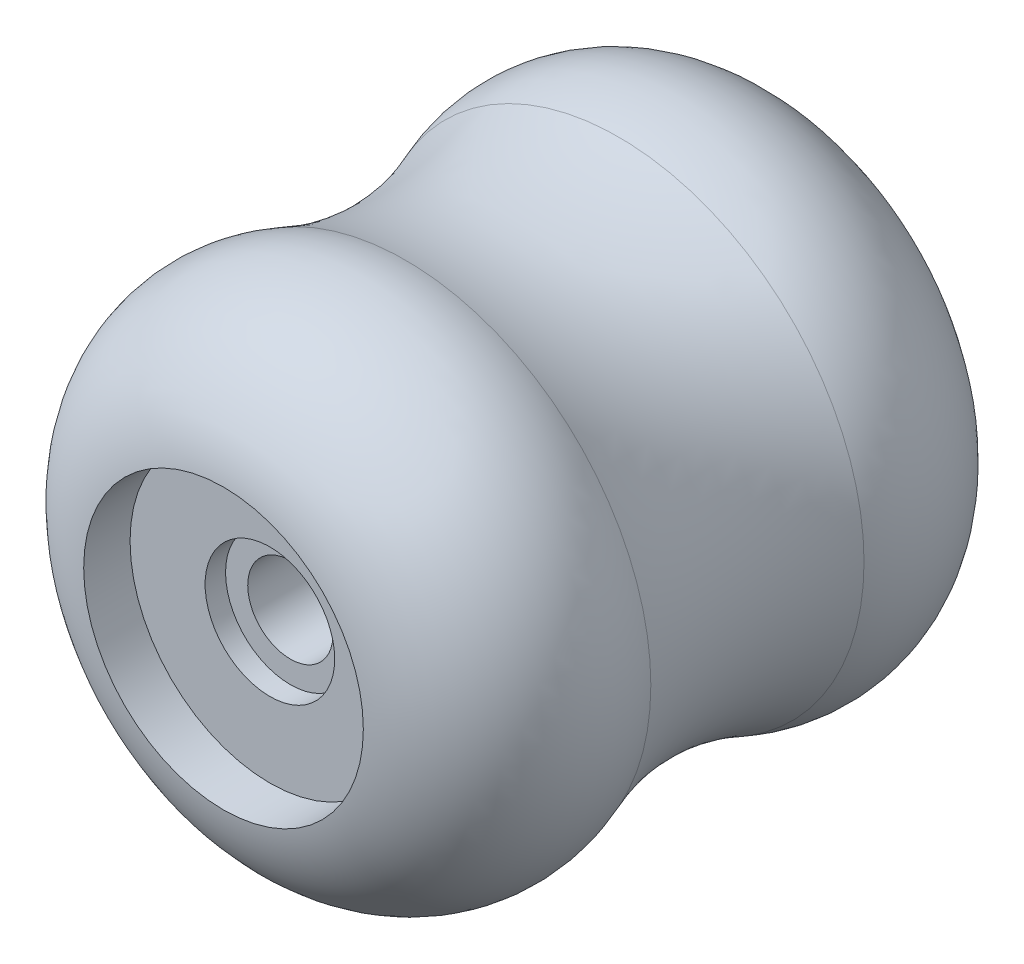
ISO-10303-21;
HEADER;
FILE_DESCRIPTION(('STEP AP214'),'2;1');
FILE_NAME('part.step','',(''),(''),'','','');
FILE_SCHEMA(('AUTOMOTIVE_DESIGN { 1 0 10303 214 1 1 1 1 }'));
ENDSEC;
DATA;
#1=APPLICATION_CONTEXT('core data for automotive mechanical design processes');
#2=APPLICATION_PROTOCOL_DEFINITION('international standard','automotive_design',2000,#1);
#3=PRODUCT_CONTEXT('',#1,'mechanical');
#4=PRODUCT('Part','Part','',(#3));
#5=PRODUCT_RELATED_PRODUCT_CATEGORY('part','',(#4));
#6=PRODUCT_DEFINITION_FORMATION('','',#4);
#7=PRODUCT_DEFINITION_CONTEXT('part definition',#1,'design');
#8=PRODUCT_DEFINITION('design','',#6,#7);
#9=PRODUCT_DEFINITION_SHAPE('','',#8);
#10=(LENGTH_UNIT() NAMED_UNIT(*) SI_UNIT(.MILLI.,.METRE.));
#11=(NAMED_UNIT(*) PLANE_ANGLE_UNIT() SI_UNIT($,.RADIAN.));
#12=(NAMED_UNIT(*) SI_UNIT($,.STERADIAN.) SOLID_ANGLE_UNIT());
#13=UNCERTAINTY_MEASURE_WITH_UNIT(LENGTH_MEASURE(1.E-05),#10,'distance_accuracy_value','');
#14=(GEOMETRIC_REPRESENTATION_CONTEXT(3) GLOBAL_UNCERTAINTY_ASSIGNED_CONTEXT((#13)) GLOBAL_UNIT_ASSIGNED_CONTEXT((#10,
#11,#12)) REPRESENTATION_CONTEXT('',''));
#15=CARTESIAN_POINT('',(0.,0.,0.));
#16=DIRECTION('',(0.,0.,1.));
#17=DIRECTION('',(1.,0.,0.));
#18=AXIS2_PLACEMENT_3D('',#15,#16,#17);
#19=CARTESIAN_POINT('',(0.,0.,21.59));
#20=DIRECTION('',(0.,0.,-1.));
#21=DIRECTION('',(-1.,0.,0.));
#22=AXIS2_PLACEMENT_3D('',#19,#20,#21);
#23=CYLINDRICAL_SURFACE('',#22,3.175);
#24=CARTESIAN_POINT('',(0.,0.,-16.51));
#25=DIRECTION('',(0.,0.,-1.));
#26=DIRECTION('',(-1.,0.,0.));
#27=AXIS2_PLACEMENT_3D('',#24,#25,#26);
#28=CIRCLE('',#27,3.175);
#29=CARTESIAN_POINT('',(-3.17500000000001,0.,-16.51));
#30=VERTEX_POINT('',#29);
#31=EDGE_CURVE('E73',#30,#30,#28,.T.);
#32=ORIENTED_EDGE('',*,*,#31,.T.);
#33=EDGE_LOOP('',(#32));
#34=FACE_BOUND('',#33,.T.);
#35=CARTESIAN_POINT('',(0.,0.,16.51));
#36=DIRECTION('',(0.,0.,-1.));
#37=DIRECTION('',(-1.,0.,0.));
#38=AXIS2_PLACEMENT_3D('',#35,#36,#37);
#39=CIRCLE('',#38,3.175);
#40=CARTESIAN_POINT('',(-3.17500000000001,0.,16.51));
#41=VERTEX_POINT('',#40);
#42=EDGE_CURVE('E89',#41,#41,#39,.T.);
#43=ORIENTED_EDGE('',*,*,#42,.F.);
#44=EDGE_LOOP('',(#43));
#45=FACE_BOUND('',#44,.T.);
#46=ADVANCED_FACE('F37',(#34,#45),#23,.F.);
#47=CARTESIAN_POINT('',(0.,0.,11.6091603767689));
#48=DIRECTION('',(0.,0.,1.));
#49=DIRECTION('',(1.,0.,0.));
#50=AXIS2_PLACEMENT_3D('',#47,#48,#49);
#51=DEGENERATE_TOROIDAL_SURFACE('',#50,8.99509487970923,9.98083962323108,.T.);
#52=CARTESIAN_POINT('',(0.,0.,7.93902777137447));
#53=DIRECTION('',(0.,0.,1.));
#54=DIRECTION('',(1.,0.,0.));
#55=AXIS2_PLACEMENT_3D('',#52,#53,#54);
#56=CIRCLE('',#55,18.2766511200969);
#57=CARTESIAN_POINT('',(18.2766511200969,0.,7.93902777137446));
#58=VERTEX_POINT('',#57);
#59=EDGE_CURVE('E46',#58,#58,#56,.T.);
#60=ORIENTED_EDGE('',*,*,#59,.T.);
#61=EDGE_LOOP('',(#60));
#62=FACE_BOUND('',#61,.T.);
#63=CARTESIAN_POINT('',(0.,0.,21.4886273585586));
#64=DIRECTION('',(0.,0.,-1.));
#65=DIRECTION('',(-1.,0.,0.));
#66=AXIS2_PLACEMENT_3D('',#63,#64,#65);
#67=CIRCLE('',#66,10.414);
#68=CARTESIAN_POINT('',(-10.414,0.,21.4886273585586));
#69=VERTEX_POINT('',#68);
#70=EDGE_CURVE('E41',#69,#69,#67,.F.);
#71=ORIENTED_EDGE('',*,*,#70,.F.);
#72=EDGE_LOOP('',(#71));
#73=FACE_BOUND('',#72,.T.);
#74=ADVANCED_FACE('F98',(#62,#73),#51,.T.);
#75=CARTESIAN_POINT('',(0.,0.,-11.6091603767689));
#76=DIRECTION('',(0.,0.,1.));
#77=DIRECTION('',(1.,0.,0.));
#78=AXIS2_PLACEMENT_3D('',#75,#76,#77);
#79=DEGENERATE_TOROIDAL_SURFACE('',#78,8.99509487970922,9.98083962323107,.T.);
#80=CARTESIAN_POINT('',(0.,0.,-21.4886273585586));
#81=DIRECTION('',(0.,0.,1.));
#82=DIRECTION('',(1.,0.,0.));
#83=AXIS2_PLACEMENT_3D('',#80,#81,#82);
#84=CIRCLE('',#83,10.414);
#85=CARTESIAN_POINT('',(10.414,0.,-21.4886273585586));
#86=VERTEX_POINT('',#85);
#87=EDGE_CURVE('E52',#86,#86,#84,.T.);
#88=ORIENTED_EDGE('',*,*,#87,.T.);
#89=EDGE_LOOP('',(#88));
#90=FACE_BOUND('',#89,.T.);
#91=CARTESIAN_POINT('',(0.,0.,-7.93902777137448));
#92=DIRECTION('',(0.,0.,1.));
#93=DIRECTION('',(1.,0.,0.));
#94=AXIS2_PLACEMENT_3D('',#91,#92,#93);
#95=CIRCLE('',#94,18.2766511200969);
#96=CARTESIAN_POINT('',(18.2766511200969,0.,-7.93902777137448));
#97=VERTEX_POINT('',#96);
#98=EDGE_CURVE('E10',#97,#97,#95,.T.);
#99=ORIENTED_EDGE('',*,*,#98,.F.);
#100=EDGE_LOOP('',(#99));
#101=FACE_BOUND('',#100,.T.);
#102=ADVANCED_FACE('F39',(#90,#101),#79,.T.);
#103=CARTESIAN_POINT('',(0.,0.,0.));
#104=DIRECTION('',(0.,0.,1.));
#105=DIRECTION('',(1.,0.,0.));
#106=AXIS2_PLACEMENT_3D('',#103,#104,#105);
#107=TOROIDAL_SURFACE('',#106,38.354,21.59);
#108=ORIENTED_EDGE('',*,*,#59,.F.);
#109=EDGE_LOOP('',(#108));
#110=FACE_BOUND('',#109,.T.);
#111=ORIENTED_EDGE('',*,*,#98,.T.);
#112=EDGE_LOOP('',(#111));
#113=FACE_BOUND('',#112,.T.);
#114=ADVANCED_FACE('F123',(#110,#113),#107,.F.);
#115=CARTESIAN_POINT('',(0.,0.,-18.034));
#116=DIRECTION('',(0.,0.,-1.));
#117=DIRECTION('',(-1.,0.,0.));
#118=AXIS2_PLACEMENT_3D('',#115,#116,#117);
#119=CYLINDRICAL_SURFACE('',#118,10.414);
#120=CARTESIAN_POINT('',(0.,0.,-18.034));
#121=DIRECTION('',(0.,0.,-1.));
#122=DIRECTION('',(-1.,0.,0.));
#123=AXIS2_PLACEMENT_3D('',#120,#121,#122);
#124=CIRCLE('',#123,10.414);
#125=CARTESIAN_POINT('',(-10.414,0.,-18.034));
#126=VERTEX_POINT('',#125);
#127=EDGE_CURVE('E57',#126,#126,#124,.T.);
#128=ORIENTED_EDGE('',*,*,#127,.F.);
#129=EDGE_LOOP('',(#128));
#130=FACE_BOUND('',#129,.T.);
#131=ORIENTED_EDGE('',*,*,#87,.F.);
#132=EDGE_LOOP('',(#131));
#133=FACE_BOUND('',#132,.T.);
#134=ADVANCED_FACE('F121',(#130,#133),#119,.F.);
#135=CARTESIAN_POINT('',(0.,0.,-18.034));
#136=DIRECTION('',(0.,0.,-1.));
#137=DIRECTION('',(-1.,0.,0.));
#138=AXIS2_PLACEMENT_3D('',#135,#136,#137);
#139=PLANE('',#138);
#140=ORIENTED_EDGE('',*,*,#127,.T.);
#141=EDGE_LOOP('',(#140));
#142=FACE_BOUND('',#141,.T.);
#143=CARTESIAN_POINT('',(0.,0.,-18.034));
#144=DIRECTION('',(0.,0.,-1.));
#145=DIRECTION('',(-1.,0.,0.));
#146=AXIS2_PLACEMENT_3D('',#143,#144,#145);
#147=CIRCLE('',#146,4.826);
#148=CARTESIAN_POINT('',(-4.82600000000001,0.,-18.034));
#149=VERTEX_POINT('',#148);
#150=EDGE_CURVE('E62',#149,#149,#147,.T.);
#151=ORIENTED_EDGE('',*,*,#150,.F.);
#152=EDGE_LOOP('',(#151));
#153=FACE_BOUND('',#152,.T.);
#154=ADVANCED_FACE('F117',(#142,#153),#139,.T.);
#155=CARTESIAN_POINT('',(0.,0.,-16.51));
#156=DIRECTION('',(0.,0.,-1.));
#157=DIRECTION('',(-1.,0.,0.));
#158=AXIS2_PLACEMENT_3D('',#155,#156,#157);
#159=CYLINDRICAL_SURFACE('',#158,4.826);
#160=ORIENTED_EDGE('',*,*,#150,.T.);
#161=EDGE_LOOP('',(#160));
#162=FACE_BOUND('',#161,.T.);
#163=CARTESIAN_POINT('',(0.,0.,-16.51));
#164=DIRECTION('',(0.,0.,-1.));
#165=DIRECTION('',(-1.,0.,0.));
#166=AXIS2_PLACEMENT_3D('',#163,#164,#165);
#167=CIRCLE('',#166,4.826);
#168=CARTESIAN_POINT('',(-4.82600000000001,0.,-16.51));
#169=VERTEX_POINT('',#168);
#170=EDGE_CURVE('E67',#169,#169,#167,.T.);
#171=ORIENTED_EDGE('',*,*,#170,.F.);
#172=EDGE_LOOP('',(#171));
#173=FACE_BOUND('',#172,.T.);
#174=ADVANCED_FACE('F113',(#162,#173),#159,.F.);
#175=CARTESIAN_POINT('',(0.,0.,-16.51));
#176=DIRECTION('',(0.,0.,-1.));
#177=DIRECTION('',(-1.,0.,0.));
#178=AXIS2_PLACEMENT_3D('',#175,#176,#177);
#179=PLANE('',#178);
#180=ORIENTED_EDGE('',*,*,#31,.F.);
#181=EDGE_LOOP('',(#180));
#182=FACE_BOUND('',#181,.T.);
#183=ORIENTED_EDGE('',*,*,#170,.T.);
#184=EDGE_LOOP('',(#183));
#185=FACE_BOUND('',#184,.T.);
#186=ADVANCED_FACE('F110',(#182,#185),#179,.T.);
#187=CARTESIAN_POINT('',(0.,0.,18.034));
#188=DIRECTION('',(0.,0.,1.));
#189=DIRECTION('',(1.,0.,0.));
#190=AXIS2_PLACEMENT_3D('',#187,#188,#189);
#191=CYLINDRICAL_SURFACE('',#190,10.414);
#192=CARTESIAN_POINT('',(0.,0.,18.034));
#193=DIRECTION('',(0.,0.,-1.));
#194=DIRECTION('',(-1.,0.,0.));
#195=AXIS2_PLACEMENT_3D('',#192,#193,#194);
#196=CIRCLE('',#195,10.414);
#197=CARTESIAN_POINT('',(-10.414,0.,18.034));
#198=VERTEX_POINT('',#197);
#199=EDGE_CURVE('E77',#198,#198,#196,.T.);
#200=ORIENTED_EDGE('',*,*,#199,.T.);
#201=EDGE_LOOP('',(#200));
#202=FACE_BOUND('',#201,.T.);
#203=ORIENTED_EDGE('',*,*,#70,.T.);
#204=EDGE_LOOP('',(#203));
#205=FACE_BOUND('',#204,.T.);
#206=ADVANCED_FACE('F108',(#202,#205),#191,.F.);
#207=CARTESIAN_POINT('',(0.,0.,18.034));
#208=DIRECTION('',(0.,0.,1.));
#209=DIRECTION('',(-1.,0.,0.));
#210=AXIS2_PLACEMENT_3D('',#207,#208,#209);
#211=PLANE('',#210);
#212=ORIENTED_EDGE('',*,*,#199,.F.);
#213=EDGE_LOOP('',(#212));
#214=FACE_BOUND('',#213,.T.);
#215=CARTESIAN_POINT('',(0.,0.,18.034));
#216=DIRECTION('',(0.,0.,1.));
#217=DIRECTION('',(1.,0.,0.));
#218=AXIS2_PLACEMENT_3D('',#215,#216,#217);
#219=CIRCLE('',#218,4.826);
#220=CARTESIAN_POINT('',(4.82599999999999,0.,18.034));
#221=VERTEX_POINT('',#220);
#222=EDGE_CURVE('E81',#221,#221,#219,.F.);
#223=ORIENTED_EDGE('',*,*,#222,.T.);
#224=EDGE_LOOP('',(#223));
#225=FACE_BOUND('',#224,.T.);
#226=ADVANCED_FACE('F137',(#214,#225),#211,.T.);
#227=CARTESIAN_POINT('',(0.,0.,16.51));
#228=DIRECTION('',(0.,0.,1.));
#229=DIRECTION('',(1.,0.,0.));
#230=AXIS2_PLACEMENT_3D('',#227,#228,#229);
#231=CYLINDRICAL_SURFACE('',#230,4.826);
#232=ORIENTED_EDGE('',*,*,#222,.F.);
#233=EDGE_LOOP('',(#232));
#234=FACE_BOUND('',#233,.T.);
#235=CARTESIAN_POINT('',(0.,0.,16.51));
#236=DIRECTION('',(0.,0.,-1.));
#237=DIRECTION('',(-1.,0.,0.));
#238=AXIS2_PLACEMENT_3D('',#235,#236,#237);
#239=CIRCLE('',#238,4.826);
#240=CARTESIAN_POINT('',(-4.82600000000001,0.,16.51));
#241=VERTEX_POINT('',#240);
#242=EDGE_CURVE('E85',#241,#241,#239,.T.);
#243=ORIENTED_EDGE('',*,*,#242,.T.);
#244=EDGE_LOOP('',(#243));
#245=FACE_BOUND('',#244,.T.);
#246=ADVANCED_FACE('F142',(#234,#245),#231,.F.);
#247=CARTESIAN_POINT('',(0.,0.,16.51));
#248=DIRECTION('',(0.,0.,1.));
#249=DIRECTION('',(-1.,0.,0.));
#250=AXIS2_PLACEMENT_3D('',#247,#248,#249);
#251=PLANE('',#250);
#252=ORIENTED_EDGE('',*,*,#42,.T.);
#253=EDGE_LOOP('',(#252));
#254=FACE_BOUND('',#253,.T.);
#255=ORIENTED_EDGE('',*,*,#242,.F.);
#256=EDGE_LOOP('',(#255));
#257=FACE_BOUND('',#256,.T.);
#258=ADVANCED_FACE('F94',(#254,#257),#251,.T.);
#259=CLOSED_SHELL('',(#46,#74,#102,#114,#134,#154,#174,#186,#206,#226,#246,#258));
#260=MANIFOLD_SOLID_BREP('B2',#259);
#261=ADVANCED_BREP_SHAPE_REPRESENTATION('',(#18,#260),#14);
#262=SHAPE_DEFINITION_REPRESENTATION(#9,#261);
ENDSEC;
END-ISO-10303-21;
